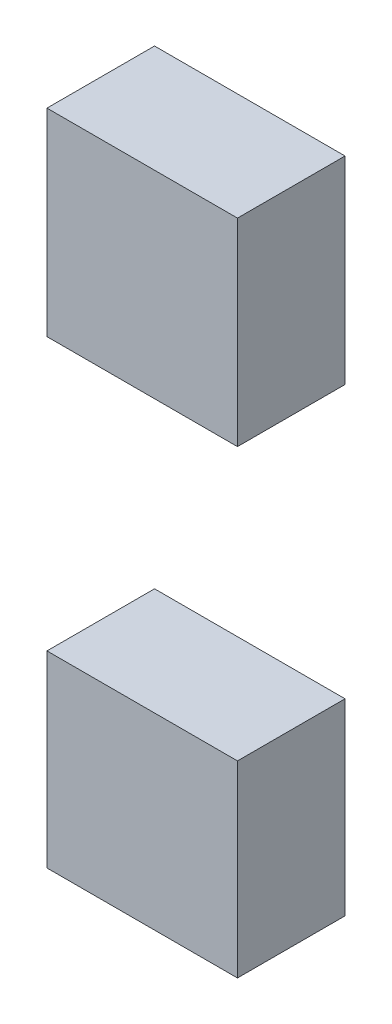
ISO-10303-21;
HEADER;
FILE_DESCRIPTION(('STEP AP214'),'2;1');
FILE_NAME('part.step','',(''),(''),'','','');
FILE_SCHEMA(('AUTOMOTIVE_DESIGN { 1 0 10303 214 1 1 1 1 }'));
ENDSEC;
DATA;
#1=APPLICATION_CONTEXT('core data for automotive mechanical design processes');
#2=APPLICATION_PROTOCOL_DEFINITION('international standard','automotive_design',2000,#1);
#3=PRODUCT_CONTEXT('',#1,'mechanical');
#4=PRODUCT('Part','Part','',(#3));
#5=PRODUCT_RELATED_PRODUCT_CATEGORY('part','',(#4));
#6=PRODUCT_DEFINITION_FORMATION('','',#4);
#7=PRODUCT_DEFINITION_CONTEXT('part definition',#1,'design');
#8=PRODUCT_DEFINITION('design','',#6,#7);
#9=PRODUCT_DEFINITION_SHAPE('','',#8);
#10=(LENGTH_UNIT() NAMED_UNIT(*) SI_UNIT(.MILLI.,.METRE.));
#11=(NAMED_UNIT(*) PLANE_ANGLE_UNIT() SI_UNIT($,.RADIAN.));
#12=(NAMED_UNIT(*) SI_UNIT($,.STERADIAN.) SOLID_ANGLE_UNIT());
#13=UNCERTAINTY_MEASURE_WITH_UNIT(LENGTH_MEASURE(1.E-05),#10,'distance_accuracy_value','');
#14=(GEOMETRIC_REPRESENTATION_CONTEXT(3) GLOBAL_UNCERTAINTY_ASSIGNED_CONTEXT((#13)) GLOBAL_UNIT_ASSIGNED_CONTEXT((#10,
#11,#12)) REPRESENTATION_CONTEXT('',''));
#15=CARTESIAN_POINT('',(0.,0.,0.));
#16=DIRECTION('',(0.,0.,1.));
#17=DIRECTION('',(1.,0.,0.));
#18=AXIS2_PLACEMENT_3D('',#15,#16,#17);
#19=CARTESIAN_POINT('',(8.85515190763742,-30.3605208261854,10.));
#20=DIRECTION('',(-1.,0.,0.));
#21=DIRECTION('',(0.,0.,1.));
#22=AXIS2_PLACEMENT_3D('',#19,#20,#21);
#23=PLANE('',#22);
#24=DIRECTION('',(0.,1.,0.));
#25=VECTOR('',#24,1.);
#26=CARTESIAN_POINT('',(8.85515190763742,-30.3605208261854,0.));
#27=LINE('',#26,#25);
#28=CARTESIAN_POINT('',(8.85515190763742,-30.3605208261854,0.));
#29=VERTEX_POINT('',#28);
#30=CARTESIAN_POINT('',(8.85515190763742,-12.8802209565635,0.));
#31=VERTEX_POINT('',#30);
#32=EDGE_CURVE('E106',#29,#31,#27,.T.);
#33=ORIENTED_EDGE('',*,*,#32,.T.);
#34=DIRECTION('',(0.,0.,-1.));
#35=VECTOR('',#34,1.);
#36=CARTESIAN_POINT('',(8.85515190763742,-12.8802209565635,10.));
#37=LINE('',#36,#35);
#38=CARTESIAN_POINT('',(8.85515190763742,-12.8802209565635,10.));
#39=VERTEX_POINT('',#38);
#40=EDGE_CURVE('E12',#39,#31,#37,.T.);
#41=ORIENTED_EDGE('',*,*,#40,.F.);
#42=DIRECTION('',(0.,1.,0.));
#43=VECTOR('',#42,1.);
#44=CARTESIAN_POINT('',(8.85515190763742,-30.3605208261854,10.));
#45=LINE('',#44,#43);
#46=CARTESIAN_POINT('',(8.85515190763742,-30.3605208261854,10.));
#47=VERTEX_POINT('',#46);
#48=EDGE_CURVE('E94',#47,#39,#45,.T.);
#49=ORIENTED_EDGE('',*,*,#48,.F.);
#50=DIRECTION('',(0.,0.,-1.));
#51=VECTOR('',#50,1.);
#52=CARTESIAN_POINT('',(8.85515190763742,-30.3605208261854,10.));
#53=LINE('',#52,#51);
#54=EDGE_CURVE('E102',#47,#29,#53,.T.);
#55=ORIENTED_EDGE('',*,*,#54,.T.);
#56=EDGE_LOOP('',(#33,#41,#49,#55));
#57=FACE_BOUND('',#56,.T.);
#58=ADVANCED_FACE('F43',(#57),#23,.F.);
#59=CARTESIAN_POINT('',(-8.85515190763742,-12.8802209565635,10.));
#60=DIRECTION('',(0.,-1.,0.));
#61=DIRECTION('',(0.,0.,-1.));
#62=AXIS2_PLACEMENT_3D('',#59,#60,#61);
#63=PLANE('',#62);
#64=DIRECTION('',(-1.,0.,0.));
#65=VECTOR('',#64,1.);
#66=CARTESIAN_POINT('',(-8.85515190763742,-12.8802209565635,0.));
#67=LINE('',#66,#65);
#68=CARTESIAN_POINT('',(-8.85515190763742,-12.8802209565635,0.));
#69=VERTEX_POINT('',#68);
#70=EDGE_CURVE('E98',#31,#69,#67,.T.);
#71=ORIENTED_EDGE('',*,*,#70,.T.);
#72=DIRECTION('',(0.,0.,-1.));
#73=VECTOR('',#72,1.);
#74=CARTESIAN_POINT('',(-8.85515190763742,-12.8802209565635,10.));
#75=LINE('',#74,#73);
#76=CARTESIAN_POINT('',(-8.85515190763742,-12.8802209565635,10.));
#77=VERTEX_POINT('',#76);
#78=EDGE_CURVE('E51',#77,#69,#75,.T.);
#79=ORIENTED_EDGE('',*,*,#78,.F.);
#80=DIRECTION('',(-1.,0.,0.));
#81=VECTOR('',#80,1.);
#82=CARTESIAN_POINT('',(-8.85515190763742,-12.8802209565635,10.));
#83=LINE('',#82,#81);
#84=EDGE_CURVE('E89',#39,#77,#83,.T.);
#85=ORIENTED_EDGE('',*,*,#84,.F.);
#86=ORIENTED_EDGE('',*,*,#40,.T.);
#87=EDGE_LOOP('',(#71,#79,#85,#86));
#88=FACE_BOUND('',#87,.T.);
#89=ADVANCED_FACE('F97',(#88),#63,.F.);
#90=CARTESIAN_POINT('',(-8.85515190763742,-30.3605208261854,10.));
#91=DIRECTION('',(1.,0.,0.));
#92=DIRECTION('',(0.,0.,-1.));
#93=AXIS2_PLACEMENT_3D('',#90,#91,#92);
#94=PLANE('',#93);
#95=DIRECTION('',(0.,-1.,0.));
#96=VECTOR('',#95,1.);
#97=CARTESIAN_POINT('',(-8.85515190763742,-30.3605208261854,0.));
#98=LINE('',#97,#96);
#99=CARTESIAN_POINT('',(-8.85515190763742,-30.3605208261854,0.));
#100=VERTEX_POINT('',#99);
#101=EDGE_CURVE('E76',#69,#100,#98,.T.);
#102=ORIENTED_EDGE('',*,*,#101,.T.);
#103=DIRECTION('',(0.,0.,-1.));
#104=VECTOR('',#103,1.);
#105=CARTESIAN_POINT('',(-8.85515190763742,-30.3605208261854,10.));
#106=LINE('',#105,#104);
#107=CARTESIAN_POINT('',(-8.85515190763742,-30.3605208261854,10.));
#108=VERTEX_POINT('',#107);
#109=EDGE_CURVE('E99',#108,#100,#106,.T.);
#110=ORIENTED_EDGE('',*,*,#109,.F.);
#111=DIRECTION('',(0.,-1.,0.));
#112=VECTOR('',#111,1.);
#113=CARTESIAN_POINT('',(-8.85515190763742,-30.3605208261854,10.));
#114=LINE('',#113,#112);
#115=EDGE_CURVE('E92',#77,#108,#114,.T.);
#116=ORIENTED_EDGE('',*,*,#115,.F.);
#117=ORIENTED_EDGE('',*,*,#78,.T.);
#118=EDGE_LOOP('',(#102,#110,#116,#117));
#119=FACE_BOUND('',#118,.T.);
#120=ADVANCED_FACE('F100',(#119),#94,.F.);
#121=CARTESIAN_POINT('',(-8.85515190763742,-30.3605208261854,10.));
#122=DIRECTION('',(0.,1.,0.));
#123=DIRECTION('',(0.,0.,1.));
#124=AXIS2_PLACEMENT_3D('',#121,#122,#123);
#125=PLANE('',#124);
#126=DIRECTION('',(1.,0.,0.));
#127=VECTOR('',#126,1.);
#128=CARTESIAN_POINT('',(-8.85515190763742,-30.3605208261854,0.));
#129=LINE('',#128,#127);
#130=EDGE_CURVE('E82',#100,#29,#129,.T.);
#131=ORIENTED_EDGE('',*,*,#130,.T.);
#132=ORIENTED_EDGE('',*,*,#54,.F.);
#133=DIRECTION('',(1.,0.,0.));
#134=VECTOR('',#133,1.);
#135=CARTESIAN_POINT('',(-8.85515190763742,-30.3605208261854,10.));
#136=LINE('',#135,#134);
#137=EDGE_CURVE('E59',#108,#47,#136,.T.);
#138=ORIENTED_EDGE('',*,*,#137,.F.);
#139=ORIENTED_EDGE('',*,*,#109,.T.);
#140=EDGE_LOOP('',(#131,#132,#138,#139));
#141=FACE_BOUND('',#140,.T.);
#142=ADVANCED_FACE('F113',(#141),#125,.F.);
#143=CARTESIAN_POINT('',(0.,0.,10.));
#144=DIRECTION('',(0.,0.,-1.));
#145=DIRECTION('',(-1.,0.,0.));
#146=AXIS2_PLACEMENT_3D('',#143,#144,#145);
#147=PLANE('',#146);
#148=ORIENTED_EDGE('',*,*,#48,.T.);
#149=ORIENTED_EDGE('',*,*,#84,.T.);
#150=ORIENTED_EDGE('',*,*,#115,.T.);
#151=ORIENTED_EDGE('',*,*,#137,.T.);
#152=EDGE_LOOP('',(#148,#149,#150,#151));
#153=FACE_BOUND('',#152,.T.);
#154=ADVANCED_FACE('F90',(#153),#147,.F.);
#155=CARTESIAN_POINT('',(0.,0.,0.));
#156=DIRECTION('',(0.,0.,-1.));
#157=DIRECTION('',(-1.,0.,0.));
#158=AXIS2_PLACEMENT_3D('',#155,#156,#157);
#159=PLANE('',#158);
#160=ORIENTED_EDGE('',*,*,#32,.F.);
#161=ORIENTED_EDGE('',*,*,#130,.F.);
#162=ORIENTED_EDGE('',*,*,#101,.F.);
#163=ORIENTED_EDGE('',*,*,#70,.F.);
#164=EDGE_LOOP('',(#160,#161,#162,#163));
#165=FACE_BOUND('',#164,.T.);
#166=ADVANCED_FACE('F116',(#165),#159,.T.);
#167=CLOSED_SHELL('',(#58,#89,#120,#142,#154,#166));
#168=MANIFOLD_SOLID_BREP('B2',#167);
#169=CARTESIAN_POINT('',(8.85515190763743,12.4202130652577,10.));
#170=DIRECTION('',(-1.,0.,0.));
#171=DIRECTION('',(0.,0.,1.));
#172=AXIS2_PLACEMENT_3D('',#169,#170,#171);
#173=PLANE('',#172);
#174=DIRECTION('',(0.,1.,0.));
#175=VECTOR('',#174,1.);
#176=CARTESIAN_POINT('',(8.85515190763743,12.4202130652577,0.));
#177=LINE('',#176,#175);
#178=CARTESIAN_POINT('',(8.85515190763743,12.4202130652577,0.));
#179=VERTEX_POINT('',#178);
#180=CARTESIAN_POINT('',(8.85515190763743,30.8205287174912,0.));
#181=VERTEX_POINT('',#180);
#182=EDGE_CURVE('E230',#179,#181,#177,.T.);
#183=ORIENTED_EDGE('',*,*,#182,.T.);
#184=DIRECTION('',(0.,0.,-1.));
#185=VECTOR('',#184,1.);
#186=CARTESIAN_POINT('',(8.85515190763743,30.8205287174912,10.));
#187=LINE('',#186,#185);
#188=CARTESIAN_POINT('',(8.85515190763743,30.8205287174912,10.));
#189=VERTEX_POINT('',#188);
#190=EDGE_CURVE('E41',#189,#181,#187,.T.);
#191=ORIENTED_EDGE('',*,*,#190,.F.);
#192=DIRECTION('',(0.,1.,0.));
#193=VECTOR('',#192,1.);
#194=CARTESIAN_POINT('',(8.85515190763743,12.4202130652577,10.));
#195=LINE('',#194,#193);
#196=CARTESIAN_POINT('',(8.85515190763743,12.4202130652577,10.));
#197=VERTEX_POINT('',#196);
#198=EDGE_CURVE('E218',#197,#189,#195,.T.);
#199=ORIENTED_EDGE('',*,*,#198,.F.);
#200=DIRECTION('',(0.,0.,-1.));
#201=VECTOR('',#200,1.);
#202=CARTESIAN_POINT('',(8.85515190763743,12.4202130652577,10.));
#203=LINE('',#202,#201);
#204=EDGE_CURVE('E226',#197,#179,#203,.T.);
#205=ORIENTED_EDGE('',*,*,#204,.T.);
#206=EDGE_LOOP('',(#183,#191,#199,#205));
#207=FACE_BOUND('',#206,.T.);
#208=ADVANCED_FACE('F167',(#207),#173,.F.);
#209=CARTESIAN_POINT('',(-8.85515190763741,30.8205287174912,10.));
#210=DIRECTION('',(0.,-1.,0.));
#211=DIRECTION('',(0.,0.,-1.));
#212=AXIS2_PLACEMENT_3D('',#209,#210,#211);
#213=PLANE('',#212);
#214=DIRECTION('',(-1.,0.,0.));
#215=VECTOR('',#214,1.);
#216=CARTESIAN_POINT('',(-8.85515190763741,30.8205287174912,0.));
#217=LINE('',#216,#215);
#218=CARTESIAN_POINT('',(-8.85515190763741,30.8205287174912,0.));
#219=VERTEX_POINT('',#218);
#220=EDGE_CURVE('E222',#181,#219,#217,.T.);
#221=ORIENTED_EDGE('',*,*,#220,.T.);
#222=DIRECTION('',(0.,0.,-1.));
#223=VECTOR('',#222,1.);
#224=CARTESIAN_POINT('',(-8.85515190763741,30.8205287174912,10.));
#225=LINE('',#224,#223);
#226=CARTESIAN_POINT('',(-8.85515190763741,30.8205287174912,10.));
#227=VERTEX_POINT('',#226);
#228=EDGE_CURVE('E175',#227,#219,#225,.T.);
#229=ORIENTED_EDGE('',*,*,#228,.F.);
#230=DIRECTION('',(-1.,0.,0.));
#231=VECTOR('',#230,1.);
#232=CARTESIAN_POINT('',(-8.85515190763741,30.8205287174912,10.));
#233=LINE('',#232,#231);
#234=EDGE_CURVE('E213',#189,#227,#233,.T.);
#235=ORIENTED_EDGE('',*,*,#234,.F.);
#236=ORIENTED_EDGE('',*,*,#190,.T.);
#237=EDGE_LOOP('',(#221,#229,#235,#236));
#238=FACE_BOUND('',#237,.T.);
#239=ADVANCED_FACE('F221',(#238),#213,.F.);
#240=CARTESIAN_POINT('',(-8.85515190763741,12.4202130652577,10.));
#241=DIRECTION('',(1.,0.,0.));
#242=DIRECTION('',(0.,0.,-1.));
#243=AXIS2_PLACEMENT_3D('',#240,#241,#242);
#244=PLANE('',#243);
#245=DIRECTION('',(0.,-1.,0.));
#246=VECTOR('',#245,1.);
#247=CARTESIAN_POINT('',(-8.85515190763741,12.4202130652577,0.));
#248=LINE('',#247,#246);
#249=CARTESIAN_POINT('',(-8.85515190763741,12.4202130652577,0.));
#250=VERTEX_POINT('',#249);
#251=EDGE_CURVE('E200',#219,#250,#248,.T.);
#252=ORIENTED_EDGE('',*,*,#251,.T.);
#253=DIRECTION('',(0.,0.,-1.));
#254=VECTOR('',#253,1.);
#255=CARTESIAN_POINT('',(-8.85515190763741,12.4202130652577,10.));
#256=LINE('',#255,#254);
#257=CARTESIAN_POINT('',(-8.85515190763741,12.4202130652577,10.));
#258=VERTEX_POINT('',#257);
#259=EDGE_CURVE('E223',#258,#250,#256,.T.);
#260=ORIENTED_EDGE('',*,*,#259,.F.);
#261=DIRECTION('',(0.,-1.,0.));
#262=VECTOR('',#261,1.);
#263=CARTESIAN_POINT('',(-8.85515190763741,12.4202130652577,10.));
#264=LINE('',#263,#262);
#265=EDGE_CURVE('E216',#227,#258,#264,.T.);
#266=ORIENTED_EDGE('',*,*,#265,.F.);
#267=ORIENTED_EDGE('',*,*,#228,.T.);
#268=EDGE_LOOP('',(#252,#260,#266,#267));
#269=FACE_BOUND('',#268,.T.);
#270=ADVANCED_FACE('F224',(#269),#244,.F.);
#271=CARTESIAN_POINT('',(-8.85515190763741,12.4202130652577,10.));
#272=DIRECTION('',(0.,1.,0.));
#273=DIRECTION('',(0.,0.,1.));
#274=AXIS2_PLACEMENT_3D('',#271,#272,#273);
#275=PLANE('',#274);
#276=DIRECTION('',(1.,0.,0.));
#277=VECTOR('',#276,1.);
#278=CARTESIAN_POINT('',(-8.85515190763741,12.4202130652577,0.));
#279=LINE('',#278,#277);
#280=EDGE_CURVE('E206',#250,#179,#279,.T.);
#281=ORIENTED_EDGE('',*,*,#280,.T.);
#282=ORIENTED_EDGE('',*,*,#204,.F.);
#283=DIRECTION('',(1.,0.,0.));
#284=VECTOR('',#283,1.);
#285=CARTESIAN_POINT('',(-8.85515190763741,12.4202130652577,10.));
#286=LINE('',#285,#284);
#287=EDGE_CURVE('E183',#258,#197,#286,.T.);
#288=ORIENTED_EDGE('',*,*,#287,.F.);
#289=ORIENTED_EDGE('',*,*,#259,.T.);
#290=EDGE_LOOP('',(#281,#282,#288,#289));
#291=FACE_BOUND('',#290,.T.);
#292=ADVANCED_FACE('F237',(#291),#275,.F.);
#293=CARTESIAN_POINT('',(0.,0.,10.));
#294=DIRECTION('',(0.,0.,-1.));
#295=DIRECTION('',(-1.,0.,0.));
#296=AXIS2_PLACEMENT_3D('',#293,#294,#295);
#297=PLANE('',#296);
#298=ORIENTED_EDGE('',*,*,#198,.T.);
#299=ORIENTED_EDGE('',*,*,#234,.T.);
#300=ORIENTED_EDGE('',*,*,#265,.T.);
#301=ORIENTED_EDGE('',*,*,#287,.T.);
#302=EDGE_LOOP('',(#298,#299,#300,#301));
#303=FACE_BOUND('',#302,.T.);
#304=ADVANCED_FACE('F214',(#303),#297,.F.);
#305=CARTESIAN_POINT('',(0.,0.,0.));
#306=DIRECTION('',(0.,0.,-1.));
#307=DIRECTION('',(-1.,0.,0.));
#308=AXIS2_PLACEMENT_3D('',#305,#306,#307);
#309=PLANE('',#308);
#310=ORIENTED_EDGE('',*,*,#182,.F.);
#311=ORIENTED_EDGE('',*,*,#280,.F.);
#312=ORIENTED_EDGE('',*,*,#251,.F.);
#313=ORIENTED_EDGE('',*,*,#220,.F.);
#314=EDGE_LOOP('',(#310,#311,#312,#313));
#315=FACE_BOUND('',#314,.T.);
#316=ADVANCED_FACE('F240',(#315),#309,.T.);
#317=CLOSED_SHELL('',(#208,#239,#270,#292,#304,#316));
#318=MANIFOLD_SOLID_BREP('B6',#317);
#319=ADVANCED_BREP_SHAPE_REPRESENTATION('',(#18,#168,#318),#14);
#320=SHAPE_DEFINITION_REPRESENTATION(#9,#319);
ENDSEC;
END-ISO-10303-21;
